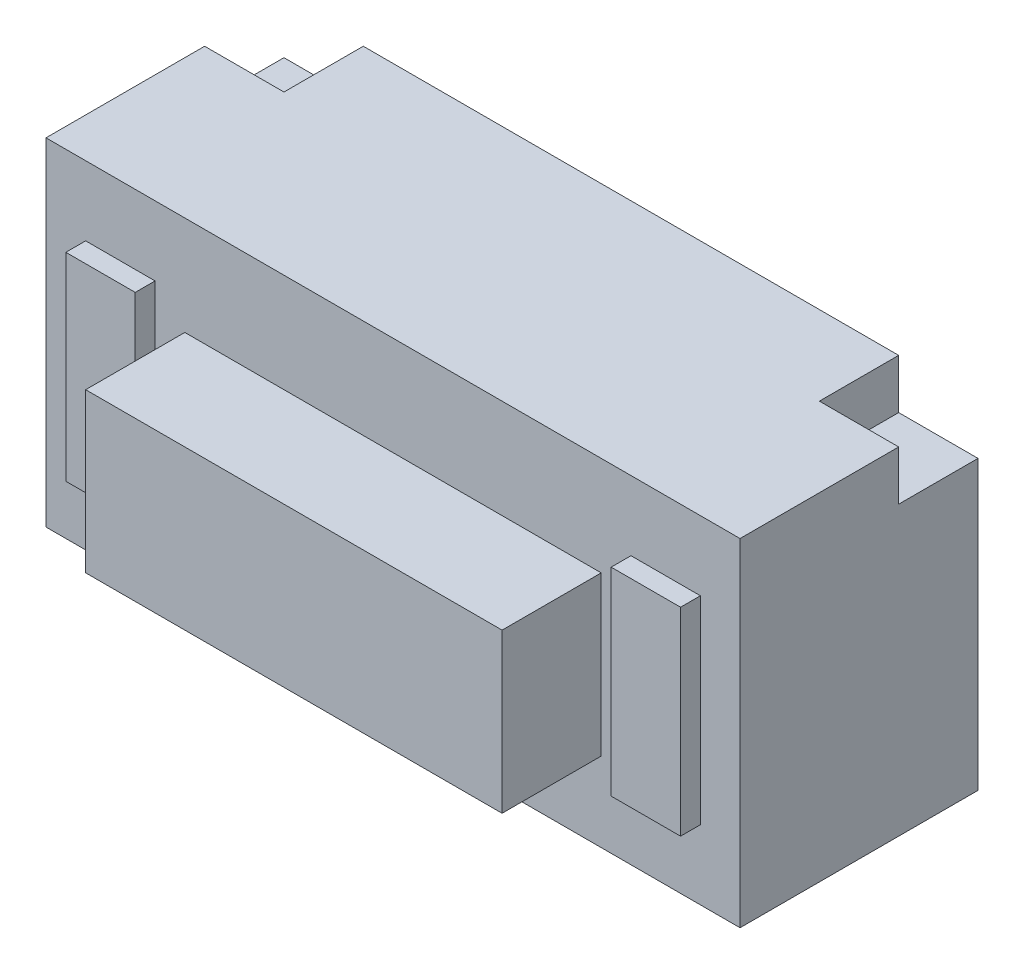
ISO-10303-21;
HEADER;
FILE_DESCRIPTION(('STEP AP214'),'2;1');
FILE_NAME('part.step','',(''),(''),'','','');
FILE_SCHEMA(('AUTOMOTIVE_DESIGN { 1 0 10303 214 1 1 1 1 }'));
ENDSEC;
DATA;
#1=APPLICATION_CONTEXT('core data for automotive mechanical design processes');
#2=APPLICATION_PROTOCOL_DEFINITION('international standard','automotive_design',2000,#1);
#3=PRODUCT_CONTEXT('',#1,'mechanical');
#4=PRODUCT('Part','Part','',(#3));
#5=PRODUCT_RELATED_PRODUCT_CATEGORY('part','',(#4));
#6=PRODUCT_DEFINITION_FORMATION('','',#4);
#7=PRODUCT_DEFINITION_CONTEXT('part definition',#1,'design');
#8=PRODUCT_DEFINITION('design','',#6,#7);
#9=PRODUCT_DEFINITION_SHAPE('','',#8);
#10=(LENGTH_UNIT() NAMED_UNIT(*) SI_UNIT(.MILLI.,.METRE.));
#11=(NAMED_UNIT(*) PLANE_ANGLE_UNIT() SI_UNIT($,.RADIAN.));
#12=(NAMED_UNIT(*) SI_UNIT($,.STERADIAN.) SOLID_ANGLE_UNIT());
#13=UNCERTAINTY_MEASURE_WITH_UNIT(LENGTH_MEASURE(1.E-05),#10,'distance_accuracy_value','');
#14=(GEOMETRIC_REPRESENTATION_CONTEXT(3) GLOBAL_UNCERTAINTY_ASSIGNED_CONTEXT((#13)) GLOBAL_UNIT_ASSIGNED_CONTEXT((#10,
#11,#12)) REPRESENTATION_CONTEXT('',''));
#15=CARTESIAN_POINT('',(0.,0.,0.));
#16=DIRECTION('',(0.,0.,1.));
#17=DIRECTION('',(1.,0.,0.));
#18=AXIS2_PLACEMENT_3D('',#15,#16,#17);
#19=CARTESIAN_POINT('',(-3.5,3.4,1.2));
#20=DIRECTION('',(0.,0.,-1.));
#21=DIRECTION('',(-1.,0.,0.));
#22=AXIS2_PLACEMENT_3D('',#19,#20,#21);
#23=PLANE('',#22);
#24=DIRECTION('',(0.,-1.,0.));
#25=VECTOR('',#24,1.);
#26=CARTESIAN_POINT('',(-2.1,2.4,1.2));
#27=LINE('',#26,#25);
#28=CARTESIAN_POINT('',(-2.1,2.4,1.2));
#29=VERTEX_POINT('',#28);
#30=CARTESIAN_POINT('',(-2.1,0.8,1.2));
#31=VERTEX_POINT('',#30);
#32=EDGE_CURVE('E239',#29,#31,#27,.T.);
#33=ORIENTED_EDGE('',*,*,#32,.F.);
#34=DIRECTION('',(-1.,0.,0.));
#35=VECTOR('',#34,1.);
#36=CARTESIAN_POINT('',(-2.1,2.4,1.2));
#37=LINE('',#36,#35);
#38=CARTESIAN_POINT('',(2.1,2.4,1.2));
#39=VERTEX_POINT('',#38);
#40=EDGE_CURVE('E188',#39,#29,#37,.T.);
#41=ORIENTED_EDGE('',*,*,#40,.F.);
#42=DIRECTION('',(0.,1.,0.));
#43=VECTOR('',#42,1.);
#44=CARTESIAN_POINT('',(2.1,2.4,1.2));
#45=LINE('',#44,#43);
#46=CARTESIAN_POINT('',(2.1,0.8,1.2));
#47=VERTEX_POINT('',#46);
#48=EDGE_CURVE('E244',#47,#39,#45,.T.);
#49=ORIENTED_EDGE('',*,*,#48,.F.);
#50=DIRECTION('',(1.,0.,0.));
#51=VECTOR('',#50,1.);
#52=CARTESIAN_POINT('',(-2.1,0.8,1.2));
#53=LINE('',#52,#51);
#54=EDGE_CURVE('E241',#31,#47,#53,.T.);
#55=ORIENTED_EDGE('',*,*,#54,.F.);
#56=EDGE_LOOP('',(#33,#41,#49,#55));
#57=FACE_BOUND('',#56,.T.);
#58=DIRECTION('',(1.,0.,0.));
#59=VECTOR('',#58,1.);
#60=CARTESIAN_POINT('',(-3.5,0.,1.2));
#61=LINE('',#60,#59);
#62=CARTESIAN_POINT('',(-3.5,0.,1.2));
#63=VERTEX_POINT('',#62);
#64=CARTESIAN_POINT('',(3.5,0.,1.2));
#65=VERTEX_POINT('',#64);
#66=EDGE_CURVE('E338',#63,#65,#61,.T.);
#67=ORIENTED_EDGE('',*,*,#66,.T.);
#68=DIRECTION('',(0.,-1.,0.));
#69=VECTOR('',#68,1.);
#70=CARTESIAN_POINT('',(3.5,3.4,1.2));
#71=LINE('',#70,#69);
#72=CARTESIAN_POINT('',(3.5,3.4,1.2));
#73=VERTEX_POINT('',#72);
#74=EDGE_CURVE('E344',#73,#65,#71,.T.);
#75=ORIENTED_EDGE('',*,*,#74,.F.);
#76=DIRECTION('',(1.,0.,0.));
#77=VECTOR('',#76,1.);
#78=CARTESIAN_POINT('',(-3.5,3.4,1.2));
#79=LINE('',#78,#77);
#80=CARTESIAN_POINT('',(-3.5,3.4,1.2));
#81=VERTEX_POINT('',#80);
#82=EDGE_CURVE('E342',#81,#73,#79,.T.);
#83=ORIENTED_EDGE('',*,*,#82,.F.);
#84=DIRECTION('',(0.,-1.,0.));
#85=VECTOR('',#84,1.);
#86=CARTESIAN_POINT('',(-3.5,3.4,1.2));
#87=LINE('',#86,#85);
#88=EDGE_CURVE('E355',#81,#63,#87,.T.);
#89=ORIENTED_EDGE('',*,*,#88,.T.);
#90=EDGE_LOOP('',(#67,#75,#83,#89));
#91=FACE_BOUND('',#90,.T.);
#92=DIRECTION('',(0.,-1.,0.));
#93=VECTOR('',#92,1.);
#94=CARTESIAN_POINT('',(-3.1,2.7,1.2));
#95=LINE('',#94,#93);
#96=CARTESIAN_POINT('',(-3.1,2.7,1.2));
#97=VERTEX_POINT('',#96);
#98=CARTESIAN_POINT('',(-3.1,0.7,1.2));
#99=VERTEX_POINT('',#98);
#100=EDGE_CURVE('E253',#97,#99,#95,.T.);
#101=ORIENTED_EDGE('',*,*,#100,.F.);
#102=DIRECTION('',(-1.,0.,0.));
#103=VECTOR('',#102,1.);
#104=CARTESIAN_POINT('',(-3.1,2.7,1.2));
#105=LINE('',#104,#103);
#106=CARTESIAN_POINT('',(-2.4,2.7,1.2));
#107=VERTEX_POINT('',#106);
#108=EDGE_CURVE('E258',#107,#97,#105,.T.);
#109=ORIENTED_EDGE('',*,*,#108,.F.);
#110=DIRECTION('',(0.,1.,0.));
#111=VECTOR('',#110,1.);
#112=CARTESIAN_POINT('',(-2.4,2.7,1.2));
#113=LINE('',#112,#111);
#114=CARTESIAN_POINT('',(-2.4,0.7,1.2));
#115=VERTEX_POINT('',#114);
#116=EDGE_CURVE('E270',#115,#107,#113,.T.);
#117=ORIENTED_EDGE('',*,*,#116,.F.);
#118=DIRECTION('',(1.,0.,0.));
#119=VECTOR('',#118,1.);
#120=CARTESIAN_POINT('',(-3.1,0.7,1.2));
#121=LINE('',#120,#119);
#122=EDGE_CURVE('E267',#99,#115,#121,.T.);
#123=ORIENTED_EDGE('',*,*,#122,.F.);
#124=EDGE_LOOP('',(#101,#109,#117,#123));
#125=FACE_BOUND('',#124,.T.);
#126=DIRECTION('',(0.,-1.,0.));
#127=VECTOR('',#126,1.);
#128=CARTESIAN_POINT('',(2.4,2.7,1.2));
#129=LINE('',#128,#127);
#130=CARTESIAN_POINT('',(2.4,2.7,1.2));
#131=VERTEX_POINT('',#130);
#132=CARTESIAN_POINT('',(2.4,0.7,1.2));
#133=VERTEX_POINT('',#132);
#134=EDGE_CURVE('E211',#131,#133,#129,.T.);
#135=ORIENTED_EDGE('',*,*,#134,.F.);
#136=DIRECTION('',(-1.,0.,0.));
#137=VECTOR('',#136,1.);
#138=CARTESIAN_POINT('',(2.4,2.7,1.2));
#139=LINE('',#138,#137);
#140=CARTESIAN_POINT('',(3.1,2.7,1.2));
#141=VERTEX_POINT('',#140);
#142=EDGE_CURVE('E216',#141,#131,#139,.T.);
#143=ORIENTED_EDGE('',*,*,#142,.F.);
#144=DIRECTION('',(0.,1.,0.));
#145=VECTOR('',#144,1.);
#146=CARTESIAN_POINT('',(3.1,2.7,1.2));
#147=LINE('',#146,#145);
#148=CARTESIAN_POINT('',(3.1,0.7,1.2));
#149=VERTEX_POINT('',#148);
#150=EDGE_CURVE('E55',#149,#141,#147,.T.);
#151=ORIENTED_EDGE('',*,*,#150,.F.);
#152=DIRECTION('',(1.,0.,0.));
#153=VECTOR('',#152,1.);
#154=CARTESIAN_POINT('',(2.4,0.7,1.2));
#155=LINE('',#154,#153);
#156=EDGE_CURVE('E50',#133,#149,#155,.T.);
#157=ORIENTED_EDGE('',*,*,#156,.F.);
#158=EDGE_LOOP('',(#135,#143,#151,#157));
#159=FACE_BOUND('',#158,.T.);
#160=ADVANCED_FACE('F35',(#57,#91,#125,#159),#23,.F.);
#161=CARTESIAN_POINT('',(3.5,3.4,1.2));
#162=DIRECTION('',(-1.,0.,0.));
#163=DIRECTION('',(0.,0.,1.));
#164=AXIS2_PLACEMENT_3D('',#161,#162,#163);
#165=PLANE('',#164);
#166=DIRECTION('',(0.,0.,-1.));
#167=VECTOR('',#166,1.);
#168=CARTESIAN_POINT('',(3.5,2.9,-1.2));
#169=LINE('',#168,#167);
#170=CARTESIAN_POINT('',(3.5,2.9,-0.4));
#171=VERTEX_POINT('',#170);
#172=CARTESIAN_POINT('',(3.5,2.9,-1.2));
#173=VERTEX_POINT('',#172);
#174=EDGE_CURVE('E287',#171,#173,#169,.T.);
#175=ORIENTED_EDGE('',*,*,#174,.F.);
#176=DIRECTION('',(0.,1.,0.));
#177=VECTOR('',#176,1.);
#178=CARTESIAN_POINT('',(3.5,2.9,-0.4));
#179=LINE('',#178,#177);
#180=CARTESIAN_POINT('',(3.5,3.4,-0.4));
#181=VERTEX_POINT('',#180);
#182=EDGE_CURVE('E303',#171,#181,#179,.T.);
#183=ORIENTED_EDGE('',*,*,#182,.T.);
#184=DIRECTION('',(0.,0.,-1.));
#185=VECTOR('',#184,1.);
#186=CARTESIAN_POINT('',(3.5,3.4,1.2));
#187=LINE('',#186,#185);
#188=EDGE_CURVE('E334',#73,#181,#187,.T.);
#189=ORIENTED_EDGE('',*,*,#188,.F.);
#190=ORIENTED_EDGE('',*,*,#74,.T.);
#191=DIRECTION('',(0.,0.,-1.));
#192=VECTOR('',#191,1.);
#193=CARTESIAN_POINT('',(3.5,0.,1.2));
#194=LINE('',#193,#192);
#195=CARTESIAN_POINT('',(3.5,0.,-1.2));
#196=VERTEX_POINT('',#195);
#197=EDGE_CURVE('E330',#65,#196,#194,.T.);
#198=ORIENTED_EDGE('',*,*,#197,.T.);
#199=DIRECTION('',(0.,-1.,0.));
#200=VECTOR('',#199,1.);
#201=CARTESIAN_POINT('',(3.5,3.4,-1.2));
#202=LINE('',#201,#200);
#203=EDGE_CURVE('E11',#173,#196,#202,.T.);
#204=ORIENTED_EDGE('',*,*,#203,.F.);
#205=EDGE_LOOP('',(#175,#183,#189,#190,#198,#204));
#206=FACE_BOUND('',#205,.T.);
#207=ADVANCED_FACE('F37',(#206),#165,.F.);
#208=CARTESIAN_POINT('',(-3.5,3.4,-1.2));
#209=DIRECTION('',(0.,0.,1.));
#210=DIRECTION('',(1.,0.,0.));
#211=AXIS2_PLACEMENT_3D('',#208,#209,#210);
#212=PLANE('',#211);
#213=DIRECTION('',(-1.,0.,0.));
#214=VECTOR('',#213,1.);
#215=CARTESIAN_POINT('',(-3.5,3.4,-1.2));
#216=LINE('',#215,#214);
#217=CARTESIAN_POINT('',(2.7,3.4,-1.2));
#218=VERTEX_POINT('',#217);
#219=CARTESIAN_POINT('',(-2.7,3.4,-1.2));
#220=VERTEX_POINT('',#219);
#221=EDGE_CURVE('E337',#218,#220,#216,.T.);
#222=ORIENTED_EDGE('',*,*,#221,.F.);
#223=DIRECTION('',(0.,1.,0.));
#224=VECTOR('',#223,1.);
#225=CARTESIAN_POINT('',(2.7,2.9,-1.2));
#226=LINE('',#225,#224);
#227=CARTESIAN_POINT('',(2.7,2.9,-1.2));
#228=VERTEX_POINT('',#227);
#229=EDGE_CURVE('E299',#228,#218,#226,.T.);
#230=ORIENTED_EDGE('',*,*,#229,.F.);
#231=DIRECTION('',(-1.,0.,0.));
#232=VECTOR('',#231,1.);
#233=CARTESIAN_POINT('',(3.5,2.9,-1.2));
#234=LINE('',#233,#232);
#235=EDGE_CURVE('E289',#173,#228,#234,.T.);
#236=ORIENTED_EDGE('',*,*,#235,.F.);
#237=ORIENTED_EDGE('',*,*,#203,.T.);
#238=DIRECTION('',(-1.,0.,0.));
#239=VECTOR('',#238,1.);
#240=CARTESIAN_POINT('',(-3.5,0.,-1.2));
#241=LINE('',#240,#239);
#242=CARTESIAN_POINT('',(-3.5,0.,-1.2));
#243=VERTEX_POINT('',#242);
#244=EDGE_CURVE('E347',#196,#243,#241,.T.);
#245=ORIENTED_EDGE('',*,*,#244,.T.);
#246=DIRECTION('',(0.,-1.,0.));
#247=VECTOR('',#246,1.);
#248=CARTESIAN_POINT('',(-3.5,3.4,-1.2));
#249=LINE('',#248,#247);
#250=CARTESIAN_POINT('',(-3.5,2.9,-1.2));
#251=VERTEX_POINT('',#250);
#252=EDGE_CURVE('E43',#251,#243,#249,.T.);
#253=ORIENTED_EDGE('',*,*,#252,.F.);
#254=DIRECTION('',(-1.,0.,0.));
#255=VECTOR('',#254,1.);
#256=CARTESIAN_POINT('',(-3.5,2.9,-1.2));
#257=LINE('',#256,#255);
#258=CARTESIAN_POINT('',(-2.7,2.9,-1.2));
#259=VERTEX_POINT('',#258);
#260=EDGE_CURVE('E320',#259,#251,#257,.T.);
#261=ORIENTED_EDGE('',*,*,#260,.F.);
#262=DIRECTION('',(0.,1.,0.));
#263=VECTOR('',#262,1.);
#264=CARTESIAN_POINT('',(-2.7,2.9,-1.2));
#265=LINE('',#264,#263);
#266=EDGE_CURVE('E327',#259,#220,#265,.T.);
#267=ORIENTED_EDGE('',*,*,#266,.T.);
#268=EDGE_LOOP('',(#222,#230,#236,#237,#245,#253,#261,#267));
#269=FACE_BOUND('',#268,.T.);
#270=ADVANCED_FACE('F369',(#269),#212,.F.);
#271=CARTESIAN_POINT('',(-3.5,3.4,1.2));
#272=DIRECTION('',(1.,0.,0.));
#273=DIRECTION('',(0.,0.,-1.));
#274=AXIS2_PLACEMENT_3D('',#271,#272,#273);
#275=PLANE('',#274);
#276=DIRECTION('',(0.,0.,1.));
#277=VECTOR('',#276,1.);
#278=CARTESIAN_POINT('',(-3.5,3.4,1.2));
#279=LINE('',#278,#277);
#280=CARTESIAN_POINT('',(-3.5,3.4,-0.4));
#281=VERTEX_POINT('',#280);
#282=EDGE_CURVE('E340',#281,#81,#279,.T.);
#283=ORIENTED_EDGE('',*,*,#282,.F.);
#284=DIRECTION('',(0.,1.,0.));
#285=VECTOR('',#284,1.);
#286=CARTESIAN_POINT('',(-3.5,2.9,-0.4));
#287=LINE('',#286,#285);
#288=CARTESIAN_POINT('',(-3.5,2.9,-0.4));
#289=VERTEX_POINT('',#288);
#290=EDGE_CURVE('E322',#289,#281,#287,.T.);
#291=ORIENTED_EDGE('',*,*,#290,.F.);
#292=DIRECTION('',(0.,0.,1.));
#293=VECTOR('',#292,1.);
#294=CARTESIAN_POINT('',(-3.5,2.9,-1.2));
#295=LINE('',#294,#293);
#296=EDGE_CURVE('E310',#251,#289,#295,.T.);
#297=ORIENTED_EDGE('',*,*,#296,.F.);
#298=ORIENTED_EDGE('',*,*,#252,.T.);
#299=DIRECTION('',(0.,0.,1.));
#300=VECTOR('',#299,1.);
#301=CARTESIAN_POINT('',(-3.5,0.,1.2));
#302=LINE('',#301,#300);
#303=EDGE_CURVE('E350',#243,#63,#302,.T.);
#304=ORIENTED_EDGE('',*,*,#303,.T.);
#305=ORIENTED_EDGE('',*,*,#88,.F.);
#306=EDGE_LOOP('',(#283,#291,#297,#298,#304,#305));
#307=FACE_BOUND('',#306,.T.);
#308=ADVANCED_FACE('F361',(#307),#275,.F.);
#309=CARTESIAN_POINT('',(0.,3.4,0.));
#310=DIRECTION('',(0.,-1.,0.));
#311=DIRECTION('',(0.,0.,-1.));
#312=AXIS2_PLACEMENT_3D('',#309,#310,#311);
#313=PLANE('',#312);
#314=ORIENTED_EDGE('',*,*,#188,.T.);
#315=DIRECTION('',(1.,0.,0.));
#316=VECTOR('',#315,1.);
#317=CARTESIAN_POINT('',(3.5,3.4,-0.4));
#318=LINE('',#317,#316);
#319=CARTESIAN_POINT('',(2.7,3.4,-0.4));
#320=VERTEX_POINT('',#319);
#321=EDGE_CURVE('E290',#320,#181,#318,.T.);
#322=ORIENTED_EDGE('',*,*,#321,.F.);
#323=DIRECTION('',(0.,0.,1.));
#324=VECTOR('',#323,1.);
#325=CARTESIAN_POINT('',(2.7,3.4,-1.2));
#326=LINE('',#325,#324);
#327=EDGE_CURVE('E286',#218,#320,#326,.T.);
#328=ORIENTED_EDGE('',*,*,#327,.F.);
#329=ORIENTED_EDGE('',*,*,#221,.T.);
#330=DIRECTION('',(0.,0.,-1.));
#331=VECTOR('',#330,1.);
#332=CARTESIAN_POINT('',(-2.7,3.4,-1.2));
#333=LINE('',#332,#331);
#334=CARTESIAN_POINT('',(-2.7,3.4,-0.4));
#335=VERTEX_POINT('',#334);
#336=EDGE_CURVE('E314',#335,#220,#333,.T.);
#337=ORIENTED_EDGE('',*,*,#336,.F.);
#338=DIRECTION('',(1.,0.,0.));
#339=VECTOR('',#338,1.);
#340=CARTESIAN_POINT('',(-3.5,3.4,-0.4));
#341=LINE('',#340,#339);
#342=EDGE_CURVE('E306',#281,#335,#341,.T.);
#343=ORIENTED_EDGE('',*,*,#342,.F.);
#344=ORIENTED_EDGE('',*,*,#282,.T.);
#345=ORIENTED_EDGE('',*,*,#82,.T.);
#346=EDGE_LOOP('',(#314,#322,#328,#329,#337,#343,#344,#345));
#347=FACE_BOUND('',#346,.T.);
#348=ADVANCED_FACE('F385',(#347),#313,.F.);
#349=CARTESIAN_POINT('',(0.,0.,0.));
#350=DIRECTION('',(0.,-1.,0.));
#351=DIRECTION('',(0.,0.,-1.));
#352=AXIS2_PLACEMENT_3D('',#349,#350,#351);
#353=PLANE('',#352);
#354=ORIENTED_EDGE('',*,*,#197,.F.);
#355=ORIENTED_EDGE('',*,*,#66,.F.);
#356=ORIENTED_EDGE('',*,*,#303,.F.);
#357=ORIENTED_EDGE('',*,*,#244,.F.);
#358=EDGE_LOOP('',(#354,#355,#356,#357));
#359=FACE_BOUND('',#358,.T.);
#360=ADVANCED_FACE('F375',(#359),#353,.T.);
#361=CARTESIAN_POINT('',(-2.7,2.9,-1.2));
#362=DIRECTION('',(1.,0.,0.));
#363=DIRECTION('',(0.,0.,-1.));
#364=AXIS2_PLACEMENT_3D('',#361,#362,#363);
#365=PLANE('',#364);
#366=ORIENTED_EDGE('',*,*,#336,.T.);
#367=ORIENTED_EDGE('',*,*,#266,.F.);
#368=DIRECTION('',(0.,0.,-1.));
#369=VECTOR('',#368,1.);
#370=CARTESIAN_POINT('',(-2.7,2.9,-1.2));
#371=LINE('',#370,#369);
#372=CARTESIAN_POINT('',(-2.7,2.9,-0.4));
#373=VERTEX_POINT('',#372);
#374=EDGE_CURVE('E317',#373,#259,#371,.T.);
#375=ORIENTED_EDGE('',*,*,#374,.F.);
#376=DIRECTION('',(0.,1.,0.));
#377=VECTOR('',#376,1.);
#378=CARTESIAN_POINT('',(-2.7,2.9,-0.4));
#379=LINE('',#378,#377);
#380=EDGE_CURVE('E331',#373,#335,#379,.T.);
#381=ORIENTED_EDGE('',*,*,#380,.T.);
#382=EDGE_LOOP('',(#366,#367,#375,#381));
#383=FACE_BOUND('',#382,.T.);
#384=ADVANCED_FACE('F396',(#383),#365,.F.);
#385=CARTESIAN_POINT('',(-3.5,2.9,-0.4));
#386=DIRECTION('',(0.,0.,1.));
#387=DIRECTION('',(1.,0.,0.));
#388=AXIS2_PLACEMENT_3D('',#385,#386,#387);
#389=PLANE('',#388);
#390=ORIENTED_EDGE('',*,*,#342,.T.);
#391=ORIENTED_EDGE('',*,*,#380,.F.);
#392=DIRECTION('',(1.,0.,0.));
#393=VECTOR('',#392,1.);
#394=CARTESIAN_POINT('',(-3.5,2.9,-0.4));
#395=LINE('',#394,#393);
#396=EDGE_CURVE('E313',#289,#373,#395,.T.);
#397=ORIENTED_EDGE('',*,*,#396,.F.);
#398=ORIENTED_EDGE('',*,*,#290,.T.);
#399=EDGE_LOOP('',(#390,#391,#397,#398));
#400=FACE_BOUND('',#399,.T.);
#401=ADVANCED_FACE('F390',(#400),#389,.F.);
#402=CARTESIAN_POINT('',(0.,2.9,0.));
#403=DIRECTION('',(0.,1.,0.));
#404=DIRECTION('',(0.,0.,1.));
#405=AXIS2_PLACEMENT_3D('',#402,#403,#404);
#406=PLANE('',#405);
#407=ORIENTED_EDGE('',*,*,#296,.T.);
#408=ORIENTED_EDGE('',*,*,#396,.T.);
#409=ORIENTED_EDGE('',*,*,#374,.T.);
#410=ORIENTED_EDGE('',*,*,#260,.T.);
#411=EDGE_LOOP('',(#407,#408,#409,#410));
#412=FACE_BOUND('',#411,.T.);
#413=ADVANCED_FACE('F393',(#412),#406,.T.);
#414=CARTESIAN_POINT('',(3.5,2.9,-0.4));
#415=DIRECTION('',(0.,0.,1.));
#416=DIRECTION('',(1.,0.,0.));
#417=AXIS2_PLACEMENT_3D('',#414,#415,#416);
#418=PLANE('',#417);
#419=ORIENTED_EDGE('',*,*,#321,.T.);
#420=ORIENTED_EDGE('',*,*,#182,.F.);
#421=DIRECTION('',(1.,0.,0.));
#422=VECTOR('',#421,1.);
#423=CARTESIAN_POINT('',(3.5,2.9,-0.4));
#424=LINE('',#423,#422);
#425=CARTESIAN_POINT('',(2.7,2.9,-0.4));
#426=VERTEX_POINT('',#425);
#427=EDGE_CURVE('E296',#426,#171,#424,.T.);
#428=ORIENTED_EDGE('',*,*,#427,.F.);
#429=DIRECTION('',(0.,1.,0.));
#430=VECTOR('',#429,1.);
#431=CARTESIAN_POINT('',(2.7,2.9,-0.4));
#432=LINE('',#431,#430);
#433=EDGE_CURVE('E307',#426,#320,#432,.T.);
#434=ORIENTED_EDGE('',*,*,#433,.T.);
#435=EDGE_LOOP('',(#419,#420,#428,#434));
#436=FACE_BOUND('',#435,.T.);
#437=ADVANCED_FACE('F403',(#436),#418,.F.);
#438=CARTESIAN_POINT('',(2.7,2.9,-1.2));
#439=DIRECTION('',(-1.,0.,0.));
#440=DIRECTION('',(0.,0.,1.));
#441=AXIS2_PLACEMENT_3D('',#438,#439,#440);
#442=PLANE('',#441);
#443=ORIENTED_EDGE('',*,*,#327,.T.);
#444=ORIENTED_EDGE('',*,*,#433,.F.);
#445=DIRECTION('',(0.,0.,1.));
#446=VECTOR('',#445,1.);
#447=CARTESIAN_POINT('',(2.7,2.9,-1.2));
#448=LINE('',#447,#446);
#449=EDGE_CURVE('E293',#228,#426,#448,.T.);
#450=ORIENTED_EDGE('',*,*,#449,.F.);
#451=ORIENTED_EDGE('',*,*,#229,.T.);
#452=EDGE_LOOP('',(#443,#444,#450,#451));
#453=FACE_BOUND('',#452,.T.);
#454=ADVANCED_FACE('F398',(#453),#442,.F.);
#455=CARTESIAN_POINT('',(0.,2.9,0.));
#456=DIRECTION('',(0.,-1.,0.));
#457=DIRECTION('',(0.,0.,-1.));
#458=AXIS2_PLACEMENT_3D('',#455,#456,#457);
#459=PLANE('',#458);
#460=ORIENTED_EDGE('',*,*,#174,.T.);
#461=ORIENTED_EDGE('',*,*,#235,.T.);
#462=ORIENTED_EDGE('',*,*,#449,.T.);
#463=ORIENTED_EDGE('',*,*,#427,.T.);
#464=EDGE_LOOP('',(#460,#461,#462,#463));
#465=FACE_BOUND('',#464,.T.);
#466=ADVANCED_FACE('F400',(#465),#459,.F.);
#467=CARTESIAN_POINT('',(-3.1,2.7,1.4));
#468=DIRECTION('',(1.,0.,0.));
#469=DIRECTION('',(0.,1.,0.));
#470=AXIS2_PLACEMENT_3D('',#467,#468,#469);
#471=PLANE('',#470);
#472=ORIENTED_EDGE('',*,*,#100,.T.);
#473=DIRECTION('',(0.,0.,-1.));
#474=VECTOR('',#473,1.);
#475=CARTESIAN_POINT('',(-3.1,0.7,1.4));
#476=LINE('',#475,#474);
#477=CARTESIAN_POINT('',(-3.1,0.7,1.4));
#478=VERTEX_POINT('',#477);
#479=EDGE_CURVE('E283',#478,#99,#476,.T.);
#480=ORIENTED_EDGE('',*,*,#479,.F.);
#481=DIRECTION('',(0.,-1.,0.));
#482=VECTOR('',#481,1.);
#483=CARTESIAN_POINT('',(-3.1,2.7,1.4));
#484=LINE('',#483,#482);
#485=CARTESIAN_POINT('',(-3.1,2.7,1.4));
#486=VERTEX_POINT('',#485);
#487=EDGE_CURVE('E254',#486,#478,#484,.T.);
#488=ORIENTED_EDGE('',*,*,#487,.F.);
#489=DIRECTION('',(0.,0.,-1.));
#490=VECTOR('',#489,1.);
#491=CARTESIAN_POINT('',(-3.1,2.7,1.4));
#492=LINE('',#491,#490);
#493=EDGE_CURVE('E264',#486,#97,#492,.T.);
#494=ORIENTED_EDGE('',*,*,#493,.T.);
#495=EDGE_LOOP('',(#472,#480,#488,#494));
#496=FACE_BOUND('',#495,.T.);
#497=ADVANCED_FACE('F477',(#496),#471,.F.);
#498=CARTESIAN_POINT('',(-3.1,0.7,1.4));
#499=DIRECTION('',(0.,1.,0.));
#500=DIRECTION('',(-1.,0.,0.));
#501=AXIS2_PLACEMENT_3D('',#498,#499,#500);
#502=PLANE('',#501);
#503=ORIENTED_EDGE('',*,*,#122,.T.);
#504=DIRECTION('',(0.,0.,-1.));
#505=VECTOR('',#504,1.);
#506=CARTESIAN_POINT('',(-2.4,0.7,1.4));
#507=LINE('',#506,#505);
#508=CARTESIAN_POINT('',(-2.4,0.7,1.4));
#509=VERTEX_POINT('',#508);
#510=EDGE_CURVE('E280',#509,#115,#507,.T.);
#511=ORIENTED_EDGE('',*,*,#510,.F.);
#512=DIRECTION('',(1.,0.,0.));
#513=VECTOR('',#512,1.);
#514=CARTESIAN_POINT('',(-3.1,0.7,1.4));
#515=LINE('',#514,#513);
#516=EDGE_CURVE('E257',#478,#509,#515,.T.);
#517=ORIENTED_EDGE('',*,*,#516,.F.);
#518=ORIENTED_EDGE('',*,*,#479,.T.);
#519=EDGE_LOOP('',(#503,#511,#517,#518));
#520=FACE_BOUND('',#519,.T.);
#521=ADVANCED_FACE('F492',(#520),#502,.F.);
#522=CARTESIAN_POINT('',(-2.4,2.7,1.4));
#523=DIRECTION('',(-1.,0.,0.));
#524=DIRECTION('',(0.,0.,1.));
#525=AXIS2_PLACEMENT_3D('',#522,#523,#524);
#526=PLANE('',#525);
#527=ORIENTED_EDGE('',*,*,#116,.T.);
#528=DIRECTION('',(0.,0.,-1.));
#529=VECTOR('',#528,1.);
#530=CARTESIAN_POINT('',(-2.4,2.7,1.4));
#531=LINE('',#530,#529);
#532=CARTESIAN_POINT('',(-2.4,2.7,1.4));
#533=VERTEX_POINT('',#532);
#534=EDGE_CURVE('E277',#533,#107,#531,.T.);
#535=ORIENTED_EDGE('',*,*,#534,.F.);
#536=DIRECTION('',(0.,1.,0.));
#537=VECTOR('',#536,1.);
#538=CARTESIAN_POINT('',(-2.4,2.7,1.4));
#539=LINE('',#538,#537);
#540=EDGE_CURVE('E260',#509,#533,#539,.T.);
#541=ORIENTED_EDGE('',*,*,#540,.F.);
#542=ORIENTED_EDGE('',*,*,#510,.T.);
#543=EDGE_LOOP('',(#527,#535,#541,#542));
#544=FACE_BOUND('',#543,.T.);
#545=ADVANCED_FACE('F502',(#544),#526,.F.);
#546=CARTESIAN_POINT('',(-3.1,2.7,1.4));
#547=DIRECTION('',(0.,-1.,0.));
#548=DIRECTION('',(0.,0.,-1.));
#549=AXIS2_PLACEMENT_3D('',#546,#547,#548);
#550=PLANE('',#549);
#551=ORIENTED_EDGE('',*,*,#108,.T.);
#552=ORIENTED_EDGE('',*,*,#493,.F.);
#553=DIRECTION('',(-1.,0.,0.));
#554=VECTOR('',#553,1.);
#555=CARTESIAN_POINT('',(-3.1,2.7,1.4));
#556=LINE('',#555,#554);
#557=EDGE_CURVE('E262',#533,#486,#556,.T.);
#558=ORIENTED_EDGE('',*,*,#557,.F.);
#559=ORIENTED_EDGE('',*,*,#534,.T.);
#560=EDGE_LOOP('',(#551,#552,#558,#559));
#561=FACE_BOUND('',#560,.T.);
#562=ADVANCED_FACE('F512',(#561),#550,.F.);
#563=CARTESIAN_POINT('',(0.,0.,1.4));
#564=DIRECTION('',(0.,0.,1.));
#565=DIRECTION('',(1.,0.,0.));
#566=AXIS2_PLACEMENT_3D('',#563,#564,#565);
#567=PLANE('',#566);
#568=ORIENTED_EDGE('',*,*,#487,.T.);
#569=ORIENTED_EDGE('',*,*,#516,.T.);
#570=ORIENTED_EDGE('',*,*,#540,.T.);
#571=ORIENTED_EDGE('',*,*,#557,.T.);
#572=EDGE_LOOP('',(#568,#569,#570,#571));
#573=FACE_BOUND('',#572,.T.);
#574=ADVANCED_FACE('F522',(#573),#567,.T.);
#575=CARTESIAN_POINT('',(-2.1,2.4,1.4));
#576=DIRECTION('',(1.,0.,0.));
#577=DIRECTION('',(0.,0.,-1.));
#578=AXIS2_PLACEMENT_3D('',#575,#576,#577);
#579=PLANE('',#578);
#580=ORIENTED_EDGE('',*,*,#32,.T.);
#581=DIRECTION('',(0.,0.,-1.));
#582=VECTOR('',#581,1.);
#583=CARTESIAN_POINT('',(-2.1,0.8,1.4));
#584=LINE('',#583,#582);
#585=CARTESIAN_POINT('',(-2.1,0.8,2.2));
#586=VERTEX_POINT('',#585);
#587=EDGE_CURVE('E197',#586,#31,#584,.T.);
#588=ORIENTED_EDGE('',*,*,#587,.F.);
#589=DIRECTION('',(0.,-1.,0.));
#590=VECTOR('',#589,1.);
#591=CARTESIAN_POINT('',(-2.1,2.4,2.2));
#592=LINE('',#591,#590);
#593=CARTESIAN_POINT('',(-2.1,2.4,2.2));
#594=VERTEX_POINT('',#593);
#595=EDGE_CURVE('E194',#594,#586,#592,.T.);
#596=ORIENTED_EDGE('',*,*,#595,.F.);
#597=DIRECTION('',(0.,0.,-1.));
#598=VECTOR('',#597,1.);
#599=CARTESIAN_POINT('',(-2.1,2.4,1.4));
#600=LINE('',#599,#598);
#601=EDGE_CURVE('E182',#594,#29,#600,.T.);
#602=ORIENTED_EDGE('',*,*,#601,.T.);
#603=EDGE_LOOP('',(#580,#588,#596,#602));
#604=FACE_BOUND('',#603,.T.);
#605=ADVANCED_FACE('F195',(#604),#579,.F.);
#606=CARTESIAN_POINT('',(-2.1,0.8,1.4));
#607=DIRECTION('',(0.,1.,0.));
#608=DIRECTION('',(-1.,0.,0.));
#609=AXIS2_PLACEMENT_3D('',#606,#607,#608);
#610=PLANE('',#609);
#611=ORIENTED_EDGE('',*,*,#54,.T.);
#612=DIRECTION('',(0.,0.,-1.));
#613=VECTOR('',#612,1.);
#614=CARTESIAN_POINT('',(2.1,0.8,1.4));
#615=LINE('',#614,#613);
#616=CARTESIAN_POINT('',(2.1,0.8,2.2));
#617=VERTEX_POINT('',#616);
#618=EDGE_CURVE('E249',#617,#47,#615,.T.);
#619=ORIENTED_EDGE('',*,*,#618,.F.);
#620=DIRECTION('',(1.,0.,0.));
#621=VECTOR('',#620,1.);
#622=CARTESIAN_POINT('',(-2.1,0.8,2.2));
#623=LINE('',#622,#621);
#624=EDGE_CURVE('E201',#586,#617,#623,.T.);
#625=ORIENTED_EDGE('',*,*,#624,.F.);
#626=ORIENTED_EDGE('',*,*,#587,.T.);
#627=EDGE_LOOP('',(#611,#619,#625,#626));
#628=FACE_BOUND('',#627,.T.);
#629=ADVANCED_FACE('F596',(#628),#610,.F.);
#630=CARTESIAN_POINT('',(2.1,2.4,1.4));
#631=DIRECTION('',(-1.,0.,0.));
#632=DIRECTION('',(0.,0.,1.));
#633=AXIS2_PLACEMENT_3D('',#630,#631,#632);
#634=PLANE('',#633);
#635=ORIENTED_EDGE('',*,*,#48,.T.);
#636=DIRECTION('',(0.,0.,-1.));
#637=VECTOR('',#636,1.);
#638=CARTESIAN_POINT('',(2.1,2.4,1.4));
#639=LINE('',#638,#637);
#640=CARTESIAN_POINT('',(2.1,2.4,2.2));
#641=VERTEX_POINT('',#640);
#642=EDGE_CURVE('E191',#641,#39,#639,.T.);
#643=ORIENTED_EDGE('',*,*,#642,.F.);
#644=DIRECTION('',(0.,1.,0.));
#645=VECTOR('',#644,1.);
#646=CARTESIAN_POINT('',(2.1,0.8,2.2));
#647=LINE('',#646,#645);
#648=EDGE_CURVE('E206',#617,#641,#647,.T.);
#649=ORIENTED_EDGE('',*,*,#648,.F.);
#650=ORIENTED_EDGE('',*,*,#618,.T.);
#651=EDGE_LOOP('',(#635,#643,#649,#650));
#652=FACE_BOUND('',#651,.T.);
#653=ADVANCED_FACE('F607',(#652),#634,.F.);
#654=CARTESIAN_POINT('',(-2.1,2.4,1.4));
#655=DIRECTION('',(0.,-1.,0.));
#656=DIRECTION('',(0.,0.,-1.));
#657=AXIS2_PLACEMENT_3D('',#654,#655,#656);
#658=PLANE('',#657);
#659=ORIENTED_EDGE('',*,*,#40,.T.);
#660=ORIENTED_EDGE('',*,*,#601,.F.);
#661=DIRECTION('',(-1.,0.,0.));
#662=VECTOR('',#661,1.);
#663=CARTESIAN_POINT('',(2.1,2.4,2.2));
#664=LINE('',#663,#662);
#665=EDGE_CURVE('E187',#641,#594,#664,.T.);
#666=ORIENTED_EDGE('',*,*,#665,.F.);
#667=ORIENTED_EDGE('',*,*,#642,.T.);
#668=EDGE_LOOP('',(#659,#660,#666,#667));
#669=FACE_BOUND('',#668,.T.);
#670=ADVANCED_FACE('F184',(#669),#658,.F.);
#671=CARTESIAN_POINT('',(2.4,2.7,1.4));
#672=DIRECTION('',(1.,0.,0.));
#673=DIRECTION('',(0.,1.,0.));
#674=AXIS2_PLACEMENT_3D('',#671,#672,#673);
#675=PLANE('',#674);
#676=ORIENTED_EDGE('',*,*,#134,.T.);
#677=DIRECTION('',(0.,0.,-1.));
#678=VECTOR('',#677,1.);
#679=CARTESIAN_POINT('',(2.4,0.7,1.4));
#680=LINE('',#679,#678);
#681=CARTESIAN_POINT('',(2.4,0.7,1.4));
#682=VERTEX_POINT('',#681);
#683=EDGE_CURVE('E237',#682,#133,#680,.T.);
#684=ORIENTED_EDGE('',*,*,#683,.F.);
#685=DIRECTION('',(0.,-1.,0.));
#686=VECTOR('',#685,1.);
#687=CARTESIAN_POINT('',(2.4,2.7,1.4));
#688=LINE('',#687,#686);
#689=CARTESIAN_POINT('',(2.4,2.7,1.4));
#690=VERTEX_POINT('',#689);
#691=EDGE_CURVE('E212',#690,#682,#688,.T.);
#692=ORIENTED_EDGE('',*,*,#691,.F.);
#693=DIRECTION('',(0.,0.,-1.));
#694=VECTOR('',#693,1.);
#695=CARTESIAN_POINT('',(2.4,2.7,1.4));
#696=LINE('',#695,#694);
#697=EDGE_CURVE('E222',#690,#131,#696,.T.);
#698=ORIENTED_EDGE('',*,*,#697,.T.);
#699=EDGE_LOOP('',(#676,#684,#692,#698));
#700=FACE_BOUND('',#699,.T.);
#701=ADVANCED_FACE('F539',(#700),#675,.F.);
#702=CARTESIAN_POINT('',(2.4,0.7,1.4));
#703=DIRECTION('',(0.,1.,0.));
#704=DIRECTION('',(-1.,0.,0.));
#705=AXIS2_PLACEMENT_3D('',#702,#703,#704);
#706=PLANE('',#705);
#707=ORIENTED_EDGE('',*,*,#156,.T.);
#708=DIRECTION('',(0.,0.,-1.));
#709=VECTOR('',#708,1.);
#710=CARTESIAN_POINT('',(3.1,0.7,1.4));
#711=LINE('',#710,#709);
#712=CARTESIAN_POINT('',(3.1,0.7,1.4));
#713=VERTEX_POINT('',#712);
#714=EDGE_CURVE('E234',#713,#149,#711,.T.);
#715=ORIENTED_EDGE('',*,*,#714,.F.);
#716=DIRECTION('',(1.,0.,0.));
#717=VECTOR('',#716,1.);
#718=CARTESIAN_POINT('',(2.4,0.7,1.4));
#719=LINE('',#718,#717);
#720=EDGE_CURVE('E215',#682,#713,#719,.T.);
#721=ORIENTED_EDGE('',*,*,#720,.F.);
#722=ORIENTED_EDGE('',*,*,#683,.T.);
#723=EDGE_LOOP('',(#707,#715,#721,#722));
#724=FACE_BOUND('',#723,.T.);
#725=ADVANCED_FACE('F544',(#724),#706,.F.);
#726=CARTESIAN_POINT('',(3.1,2.7,1.4));
#727=DIRECTION('',(-1.,0.,0.));
#728=DIRECTION('',(0.,-1.,0.));
#729=AXIS2_PLACEMENT_3D('',#726,#727,#728);
#730=PLANE('',#729);
#731=ORIENTED_EDGE('',*,*,#150,.T.);
#732=DIRECTION('',(0.,0.,-1.));
#733=VECTOR('',#732,1.);
#734=CARTESIAN_POINT('',(3.1,2.7,1.4));
#735=LINE('',#734,#733);
#736=CARTESIAN_POINT('',(3.1,2.7,1.4));
#737=VERTEX_POINT('',#736);
#738=EDGE_CURVE('E231',#737,#141,#735,.T.);
#739=ORIENTED_EDGE('',*,*,#738,.F.);
#740=DIRECTION('',(0.,1.,0.));
#741=VECTOR('',#740,1.);
#742=CARTESIAN_POINT('',(3.1,2.7,1.4));
#743=LINE('',#742,#741);
#744=EDGE_CURVE('E218',#713,#737,#743,.T.);
#745=ORIENTED_EDGE('',*,*,#744,.F.);
#746=ORIENTED_EDGE('',*,*,#714,.T.);
#747=EDGE_LOOP('',(#731,#739,#745,#746));
#748=FACE_BOUND('',#747,.T.);
#749=ADVANCED_FACE('F556',(#748),#730,.F.);
#750=CARTESIAN_POINT('',(2.4,2.7,1.4));
#751=DIRECTION('',(0.,-1.,0.));
#752=DIRECTION('',(0.,0.,-1.));
#753=AXIS2_PLACEMENT_3D('',#750,#751,#752);
#754=PLANE('',#753);
#755=ORIENTED_EDGE('',*,*,#142,.T.);
#756=ORIENTED_EDGE('',*,*,#697,.F.);
#757=DIRECTION('',(-1.,0.,0.));
#758=VECTOR('',#757,1.);
#759=CARTESIAN_POINT('',(2.4,2.7,1.4));
#760=LINE('',#759,#758);
#761=EDGE_CURVE('E220',#737,#690,#760,.T.);
#762=ORIENTED_EDGE('',*,*,#761,.F.);
#763=ORIENTED_EDGE('',*,*,#738,.T.);
#764=EDGE_LOOP('',(#755,#756,#762,#763));
#765=FACE_BOUND('',#764,.T.);
#766=ADVANCED_FACE('F566',(#765),#754,.F.);
#767=CARTESIAN_POINT('',(0.,0.,1.4));
#768=DIRECTION('',(0.,0.,1.));
#769=DIRECTION('',(1.,0.,0.));
#770=AXIS2_PLACEMENT_3D('',#767,#768,#769);
#771=PLANE('',#770);
#772=ORIENTED_EDGE('',*,*,#691,.T.);
#773=ORIENTED_EDGE('',*,*,#720,.T.);
#774=ORIENTED_EDGE('',*,*,#744,.T.);
#775=ORIENTED_EDGE('',*,*,#761,.T.);
#776=EDGE_LOOP('',(#772,#773,#774,#775));
#777=FACE_BOUND('',#776,.T.);
#778=ADVANCED_FACE('F576',(#777),#771,.T.);
#779=CARTESIAN_POINT('',(0.,0.,2.2));
#780=DIRECTION('',(0.,0.,1.));
#781=DIRECTION('',(1.,0.,0.));
#782=AXIS2_PLACEMENT_3D('',#779,#780,#781);
#783=PLANE('',#782);
#784=ORIENTED_EDGE('',*,*,#665,.T.);
#785=ORIENTED_EDGE('',*,*,#595,.T.);
#786=ORIENTED_EDGE('',*,*,#624,.T.);
#787=ORIENTED_EDGE('',*,*,#648,.T.);
#788=EDGE_LOOP('',(#784,#785,#786,#787));
#789=FACE_BOUND('',#788,.T.);
#790=ADVANCED_FACE('F204',(#789),#783,.T.);
#791=CLOSED_SHELL('',(#160,#207,#270,#308,#348,#360,#384,#401,#413,#437,#454,#466,#497,#521,
#545,#562,#574,#605,#629,#653,#670,#701,#725,#749,#766,#778,#790));
#792=MANIFOLD_SOLID_BREP('B2',#791);
#793=ADVANCED_BREP_SHAPE_REPRESENTATION('',(#18,#792),#14);
#794=SHAPE_DEFINITION_REPRESENTATION(#9,#793);
ENDSEC;
END-ISO-10303-21;
